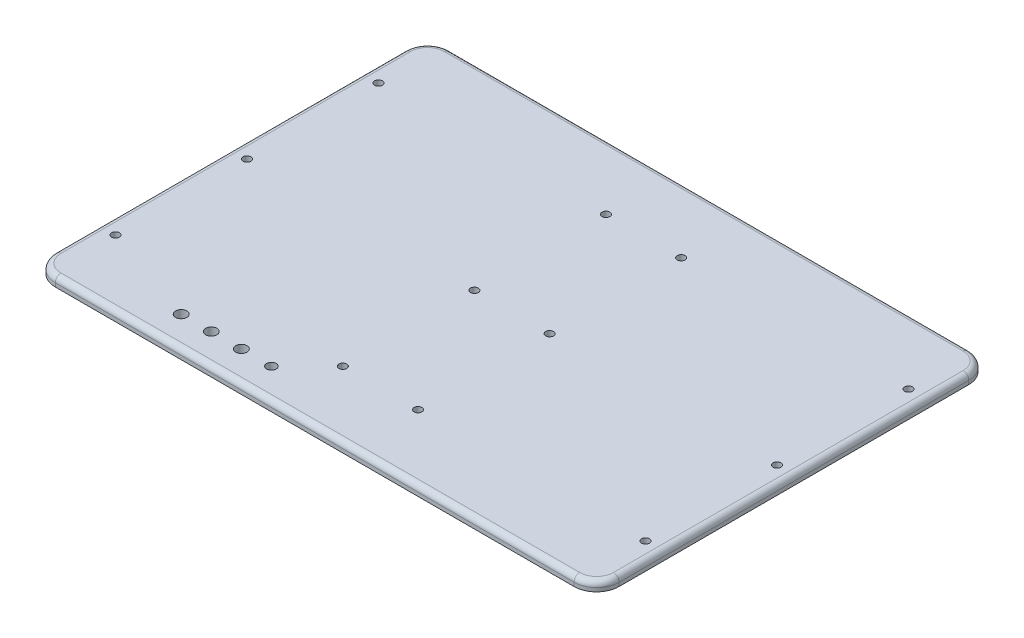
ISO-10303-21;
HEADER;
FILE_DESCRIPTION(('STEP AP214'),'2;1');
FILE_NAME('part.step','',(''),(''),'','','');
FILE_SCHEMA(('AUTOMOTIVE_DESIGN { 1 0 10303 214 1 1 1 1 }'));
ENDSEC;
DATA;
#1=APPLICATION_CONTEXT('core data for automotive mechanical design processes');
#2=APPLICATION_PROTOCOL_DEFINITION('international standard','automotive_design',2000,#1);
#3=PRODUCT_CONTEXT('',#1,'mechanical');
#4=PRODUCT('Part','Part','',(#3));
#5=PRODUCT_RELATED_PRODUCT_CATEGORY('part','',(#4));
#6=PRODUCT_DEFINITION_FORMATION('','',#4);
#7=PRODUCT_DEFINITION_CONTEXT('part definition',#1,'design');
#8=PRODUCT_DEFINITION('design','',#6,#7);
#9=PRODUCT_DEFINITION_SHAPE('','',#8);
#10=(LENGTH_UNIT() NAMED_UNIT(*) SI_UNIT(.MILLI.,.METRE.));
#11=(NAMED_UNIT(*) PLANE_ANGLE_UNIT() SI_UNIT($,.RADIAN.));
#12=(NAMED_UNIT(*) SI_UNIT($,.STERADIAN.) SOLID_ANGLE_UNIT());
#13=UNCERTAINTY_MEASURE_WITH_UNIT(LENGTH_MEASURE(1.E-05),#10,'distance_accuracy_value','');
#14=(GEOMETRIC_REPRESENTATION_CONTEXT(3) GLOBAL_UNCERTAINTY_ASSIGNED_CONTEXT((#13)) GLOBAL_UNIT_ASSIGNED_CONTEXT((#10,
#11,#12)) REPRESENTATION_CONTEXT('',''));
#15=CARTESIAN_POINT('',(0.,0.,0.));
#16=DIRECTION('',(0.,0.,1.));
#17=DIRECTION('',(1.,0.,0.));
#18=AXIS2_PLACEMENT_3D('',#15,#16,#17);
#19=CARTESIAN_POINT('',(150.,5.,-105.));
#20=DIRECTION('',(-1.,0.,0.));
#21=DIRECTION('',(0.,0.,1.));
#22=AXIS2_PLACEMENT_3D('',#19,#20,#21);
#23=PLANE('',#22);
#24=DIRECTION('',(0.,-1.,0.));
#25=VECTOR('',#24,1.);
#26=CARTESIAN_POINT('',(150.,5.,-93.));
#27=LINE('',#26,#25);
#28=CARTESIAN_POINT('',(150.,0.,-93.));
#29=VERTEX_POINT('',#28);
#30=CARTESIAN_POINT('',(150.,2.,-93.));
#31=VERTEX_POINT('',#30);
#32=EDGE_CURVE('E158',#29,#31,#27,.F.);
#33=ORIENTED_EDGE('',*,*,#32,.T.);
#34=DIRECTION('',(0.,0.,-1.));
#35=VECTOR('',#34,1.);
#36=CARTESIAN_POINT('',(150.,2.,93.));
#37=LINE('',#36,#35);
#38=CARTESIAN_POINT('',(150.,2.,93.));
#39=VERTEX_POINT('',#38);
#40=EDGE_CURVE('E241',#31,#39,#37,.F.);
#41=ORIENTED_EDGE('',*,*,#40,.T.);
#42=DIRECTION('',(0.,-1.,0.));
#43=VECTOR('',#42,1.);
#44=CARTESIAN_POINT('',(150.,5.,93.));
#45=LINE('',#44,#43);
#46=CARTESIAN_POINT('',(150.,0.,93.));
#47=VERTEX_POINT('',#46);
#48=EDGE_CURVE('E163',#39,#47,#45,.T.);
#49=ORIENTED_EDGE('',*,*,#48,.T.);
#50=DIRECTION('',(0.,0.,-1.));
#51=VECTOR('',#50,1.);
#52=CARTESIAN_POINT('',(150.,0.,-105.));
#53=LINE('',#52,#51);
#54=EDGE_CURVE('E171',#47,#29,#53,.T.);
#55=ORIENTED_EDGE('',*,*,#54,.T.);
#56=EDGE_LOOP('',(#33,#41,#49,#55));
#57=FACE_BOUND('',#56,.T.);
#58=ADVANCED_FACE('F49',(#57),#23,.F.);
#59=CARTESIAN_POINT('',(-150.,5.,-105.));
#60=DIRECTION('',(0.,0.,1.));
#61=DIRECTION('',(1.,0.,0.));
#62=AXIS2_PLACEMENT_3D('',#59,#60,#61);
#63=PLANE('',#62);
#64=DIRECTION('',(0.,-1.,0.));
#65=VECTOR('',#64,1.);
#66=CARTESIAN_POINT('',(-138.,5.,-105.));
#67=LINE('',#66,#65);
#68=CARTESIAN_POINT('',(-138.,0.,-105.));
#69=VERTEX_POINT('',#68);
#70=CARTESIAN_POINT('',(-138.,2.,-105.));
#71=VERTEX_POINT('',#70);
#72=EDGE_CURVE('E152',#69,#71,#67,.F.);
#73=ORIENTED_EDGE('',*,*,#72,.T.);
#74=DIRECTION('',(-1.,0.,0.));
#75=VECTOR('',#74,1.);
#76=CARTESIAN_POINT('',(138.,2.,-105.));
#77=LINE('',#76,#75);
#78=CARTESIAN_POINT('',(138.,2.,-105.));
#79=VERTEX_POINT('',#78);
#80=EDGE_CURVE('E11',#71,#79,#77,.F.);
#81=ORIENTED_EDGE('',*,*,#80,.T.);
#82=DIRECTION('',(0.,-1.,0.));
#83=VECTOR('',#82,1.);
#84=CARTESIAN_POINT('',(138.,5.,-105.));
#85=LINE('',#84,#83);
#86=CARTESIAN_POINT('',(138.,0.,-105.));
#87=VERTEX_POINT('',#86);
#88=EDGE_CURVE('E141',#79,#87,#85,.T.);
#89=ORIENTED_EDGE('',*,*,#88,.T.);
#90=DIRECTION('',(-1.,0.,0.));
#91=VECTOR('',#90,1.);
#92=CARTESIAN_POINT('',(-150.,0.,-105.));
#93=LINE('',#92,#91);
#94=EDGE_CURVE('E145',#87,#69,#93,.T.);
#95=ORIENTED_EDGE('',*,*,#94,.T.);
#96=EDGE_LOOP('',(#73,#81,#89,#95));
#97=FACE_BOUND('',#96,.T.);
#98=ADVANCED_FACE('F143',(#97),#63,.F.);
#99=CARTESIAN_POINT('',(-150.,5.,-105.));
#100=DIRECTION('',(1.,0.,0.));
#101=DIRECTION('',(0.,0.,-1.));
#102=AXIS2_PLACEMENT_3D('',#99,#100,#101);
#103=PLANE('',#102);
#104=DIRECTION('',(0.,-1.,0.));
#105=VECTOR('',#104,1.);
#106=CARTESIAN_POINT('',(-150.,5.,93.));
#107=LINE('',#106,#105);
#108=CARTESIAN_POINT('',(-150.,0.,93.));
#109=VERTEX_POINT('',#108);
#110=CARTESIAN_POINT('',(-150.,2.,93.));
#111=VERTEX_POINT('',#110);
#112=EDGE_CURVE('E210',#109,#111,#107,.F.);
#113=ORIENTED_EDGE('',*,*,#112,.T.);
#114=DIRECTION('',(0.,0.,1.));
#115=VECTOR('',#114,1.);
#116=CARTESIAN_POINT('',(-150.,2.,-93.));
#117=LINE('',#116,#115);
#118=CARTESIAN_POINT('',(-150.,2.,-93.));
#119=VERTEX_POINT('',#118);
#120=EDGE_CURVE('E74',#111,#119,#117,.F.);
#121=ORIENTED_EDGE('',*,*,#120,.T.);
#122=DIRECTION('',(0.,-1.,0.));
#123=VECTOR('',#122,1.);
#124=CARTESIAN_POINT('',(-150.,5.,-93.));
#125=LINE('',#124,#123);
#126=CARTESIAN_POINT('',(-150.,0.,-93.));
#127=VERTEX_POINT('',#126);
#128=EDGE_CURVE('E207',#119,#127,#125,.T.);
#129=ORIENTED_EDGE('',*,*,#128,.T.);
#130=DIRECTION('',(0.,0.,1.));
#131=VECTOR('',#130,1.);
#132=CARTESIAN_POINT('',(-150.,0.,-105.));
#133=LINE('',#132,#131);
#134=EDGE_CURVE('E170',#127,#109,#133,.T.);
#135=ORIENTED_EDGE('',*,*,#134,.T.);
#136=EDGE_LOOP('',(#113,#121,#129,#135));
#137=FACE_BOUND('',#136,.T.);
#138=ADVANCED_FACE('F402',(#137),#103,.F.);
#139=CARTESIAN_POINT('',(-150.,5.,105.));
#140=DIRECTION('',(0.,0.,-1.));
#141=DIRECTION('',(-1.,0.,0.));
#142=AXIS2_PLACEMENT_3D('',#139,#140,#141);
#143=PLANE('',#142);
#144=DIRECTION('',(0.,-1.,0.));
#145=VECTOR('',#144,1.);
#146=CARTESIAN_POINT('',(138.,5.,105.));
#147=LINE('',#146,#145);
#148=CARTESIAN_POINT('',(138.,0.,105.));
#149=VERTEX_POINT('',#148);
#150=CARTESIAN_POINT('',(138.,2.,105.));
#151=VERTEX_POINT('',#150);
#152=EDGE_CURVE('E203',#149,#151,#147,.F.);
#153=ORIENTED_EDGE('',*,*,#152,.T.);
#154=DIRECTION('',(1.,0.,0.));
#155=VECTOR('',#154,1.);
#156=CARTESIAN_POINT('',(-138.,2.,105.));
#157=LINE('',#156,#155);
#158=CARTESIAN_POINT('',(-138.,2.,105.));
#159=VERTEX_POINT('',#158);
#160=EDGE_CURVE('E247',#151,#159,#157,.F.);
#161=ORIENTED_EDGE('',*,*,#160,.T.);
#162=DIRECTION('',(0.,-1.,0.));
#163=VECTOR('',#162,1.);
#164=CARTESIAN_POINT('',(-138.,5.,105.));
#165=LINE('',#164,#163);
#166=CARTESIAN_POINT('',(-138.,0.,105.));
#167=VERTEX_POINT('',#166);
#168=EDGE_CURVE('E200',#159,#167,#165,.T.);
#169=ORIENTED_EDGE('',*,*,#168,.T.);
#170=DIRECTION('',(1.,0.,0.));
#171=VECTOR('',#170,1.);
#172=CARTESIAN_POINT('',(-150.,0.,105.));
#173=LINE('',#172,#171);
#174=EDGE_CURVE('E177',#167,#149,#173,.T.);
#175=ORIENTED_EDGE('',*,*,#174,.T.);
#176=EDGE_LOOP('',(#153,#161,#169,#175));
#177=FACE_BOUND('',#176,.T.);
#178=ADVANCED_FACE('F394',(#177),#143,.F.);
#179=CARTESIAN_POINT('',(0.,5.,0.));
#180=DIRECTION('',(0.,1.,0.));
#181=DIRECTION('',(0.,0.,1.));
#182=AXIS2_PLACEMENT_3D('',#179,#180,#181);
#183=PLANE('',#182);
#184=CARTESIAN_POINT('',(-87.,5.,89.));
#185=DIRECTION('',(0.,1.,0.));
#186=DIRECTION('',(0.,0.,1.));
#187=AXIS2_PLACEMENT_3D('',#184,#185,#186);
#188=CIRCLE('',#187,3.00000000000001);
#189=CARTESIAN_POINT('',(-87.,5.,92.));
#190=VERTEX_POINT('',#189);
#191=EDGE_CURVE('E764',#190,#190,#188,.T.);
#192=ORIENTED_EDGE('',*,*,#191,.F.);
#193=EDGE_LOOP('',(#192));
#194=FACE_BOUND('',#193,.T.);
#195=CARTESIAN_POINT('',(-55.,5.,89.));
#196=DIRECTION('',(0.,1.,0.));
#197=DIRECTION('',(0.,0.,1.));
#198=AXIS2_PLACEMENT_3D('',#195,#196,#197);
#199=CIRCLE('',#198,3.00000000000001);
#200=CARTESIAN_POINT('',(-55.,5.,92.));
#201=VERTEX_POINT('',#200);
#202=EDGE_CURVE('E779',#201,#201,#199,.T.);
#203=ORIENTED_EDGE('',*,*,#202,.F.);
#204=EDGE_LOOP('',(#203));
#205=FACE_BOUND('',#204,.T.);
#206=CARTESIAN_POINT('',(-71.,5.,89.));
#207=DIRECTION('',(0.,1.,0.));
#208=DIRECTION('',(0.,0.,1.));
#209=AXIS2_PLACEMENT_3D('',#206,#207,#208);
#210=CIRCLE('',#209,3.00000000000001);
#211=CARTESIAN_POINT('',(-71.,5.,92.));
#212=VERTEX_POINT('',#211);
#213=EDGE_CURVE('E778',#212,#212,#210,.T.);
#214=ORIENTED_EDGE('',*,*,#213,.F.);
#215=EDGE_LOOP('',(#214));
#216=FACE_BOUND('',#215,.T.);
#217=CARTESIAN_POINT('',(-39.,5.,89.));
#218=DIRECTION('',(0.,1.,0.));
#219=DIRECTION('',(0.,0.,1.));
#220=AXIS2_PLACEMENT_3D('',#217,#218,#219);
#221=CIRCLE('',#220,2.56);
#222=CARTESIAN_POINT('',(-39.,5.,91.56));
#223=VERTEX_POINT('',#222);
#224=EDGE_CURVE('E771',#223,#223,#221,.T.);
#225=ORIENTED_EDGE('',*,*,#224,.F.);
#226=EDGE_LOOP('',(#225));
#227=FACE_BOUND('',#226,.T.);
#228=DIRECTION('',(0.,0.,-1.));
#229=VECTOR('',#228,1.);
#230=CARTESIAN_POINT('',(147.,5.,-93.));
#231=LINE('',#230,#229);
#232=CARTESIAN_POINT('',(147.,5.,93.));
#233=VERTEX_POINT('',#232);
#234=CARTESIAN_POINT('',(147.,5.,-93.));
#235=VERTEX_POINT('',#234);
#236=EDGE_CURVE('E231',#233,#235,#231,.T.);
#237=ORIENTED_EDGE('',*,*,#236,.T.);
#238=CARTESIAN_POINT('',(138.,5.,-93.));
#239=DIRECTION('',(0.,1.,0.));
#240=DIRECTION('',(0.,0.,1.));
#241=AXIS2_PLACEMENT_3D('',#238,#239,#240);
#242=CIRCLE('',#241,9.);
#243=CARTESIAN_POINT('',(138.,5.,-102.));
#244=VERTEX_POINT('',#243);
#245=EDGE_CURVE('E234',#235,#244,#242,.T.);
#246=ORIENTED_EDGE('',*,*,#245,.T.);
#247=DIRECTION('',(-1.,0.,0.));
#248=VECTOR('',#247,1.);
#249=CARTESIAN_POINT('',(-138.,5.,-102.));
#250=LINE('',#249,#248);
#251=CARTESIAN_POINT('',(-138.,5.,-102.));
#252=VERTEX_POINT('',#251);
#253=EDGE_CURVE('E213',#244,#252,#250,.T.);
#254=ORIENTED_EDGE('',*,*,#253,.T.);
#255=CARTESIAN_POINT('',(-138.,5.,-93.));
#256=DIRECTION('',(0.,1.,0.));
#257=DIRECTION('',(0.,0.,1.));
#258=AXIS2_PLACEMENT_3D('',#255,#256,#257);
#259=CIRCLE('',#258,9.);
#260=CARTESIAN_POINT('',(-147.,5.,-93.));
#261=VERTEX_POINT('',#260);
#262=EDGE_CURVE('E216',#252,#261,#259,.T.);
#263=ORIENTED_EDGE('',*,*,#262,.T.);
#264=DIRECTION('',(0.,0.,1.));
#265=VECTOR('',#264,1.);
#266=CARTESIAN_POINT('',(-147.,5.,93.));
#267=LINE('',#266,#265);
#268=CARTESIAN_POINT('',(-147.,5.,93.));
#269=VERTEX_POINT('',#268);
#270=EDGE_CURVE('E219',#261,#269,#267,.T.);
#271=ORIENTED_EDGE('',*,*,#270,.T.);
#272=CARTESIAN_POINT('',(-138.,5.,93.));
#273=DIRECTION('',(0.,1.,0.));
#274=DIRECTION('',(0.,0.,1.));
#275=AXIS2_PLACEMENT_3D('',#272,#273,#274);
#276=CIRCLE('',#275,9.);
#277=CARTESIAN_POINT('',(-138.,5.,102.));
#278=VERTEX_POINT('',#277);
#279=EDGE_CURVE('E222',#269,#278,#276,.T.);
#280=ORIENTED_EDGE('',*,*,#279,.T.);
#281=DIRECTION('',(1.,0.,0.));
#282=VECTOR('',#281,1.);
#283=CARTESIAN_POINT('',(138.,5.,102.));
#284=LINE('',#283,#282);
#285=CARTESIAN_POINT('',(138.,5.,102.));
#286=VERTEX_POINT('',#285);
#287=EDGE_CURVE('E225',#278,#286,#284,.T.);
#288=ORIENTED_EDGE('',*,*,#287,.T.);
#289=CARTESIAN_POINT('',(138.,5.,93.));
#290=DIRECTION('',(0.,1.,0.));
#291=DIRECTION('',(0.,0.,1.));
#292=AXIS2_PLACEMENT_3D('',#289,#290,#291);
#293=CIRCLE('',#292,9.);
#294=EDGE_CURVE('E228',#286,#233,#293,.T.);
#295=ORIENTED_EDGE('',*,*,#294,.T.);
#296=EDGE_LOOP('',(#237,#246,#254,#263,#271,#280,#288,#295));
#297=FACE_BOUND('',#296,.T.);
#298=CARTESIAN_POINT('',(20.,5.,0.));
#299=DIRECTION('',(0.,-1.,0.));
#300=DIRECTION('',(0.,0.,1.));
#301=AXIS2_PLACEMENT_3D('',#298,#299,#300);
#302=CIRCLE('',#301,2.07499999999999);
#303=CARTESIAN_POINT('',(20.,5.,2.07499999999999));
#304=VERTEX_POINT('',#303);
#305=EDGE_CURVE('E301',#304,#304,#302,.T.);
#306=ORIENTED_EDGE('',*,*,#305,.T.);
#307=EDGE_LOOP('',(#306));
#308=FACE_BOUND('',#307,.T.);
#309=CARTESIAN_POINT('',(140.999999999999,5.,70.));
#310=DIRECTION('',(0.,-1.,0.));
#311=DIRECTION('',(0.,0.,1.));
#312=AXIS2_PLACEMENT_3D('',#309,#310,#311);
#313=CIRCLE('',#312,2.075);
#314=CARTESIAN_POINT('',(140.999999999999,5.,72.075));
#315=VERTEX_POINT('',#314);
#316=EDGE_CURVE('E310',#315,#315,#313,.T.);
#317=ORIENTED_EDGE('',*,*,#316,.T.);
#318=EDGE_LOOP('',(#317));
#319=FACE_BOUND('',#318,.T.);
#320=CARTESIAN_POINT('',(141.,5.,0.));
#321=DIRECTION('',(0.,-1.,0.));
#322=DIRECTION('',(0.,0.,1.));
#323=AXIS2_PLACEMENT_3D('',#320,#321,#322);
#324=CIRCLE('',#323,2.075);
#325=CARTESIAN_POINT('',(141.,5.,2.075));
#326=VERTEX_POINT('',#325);
#327=EDGE_CURVE('E309',#326,#326,#324,.T.);
#328=ORIENTED_EDGE('',*,*,#327,.T.);
#329=EDGE_LOOP('',(#328));
#330=FACE_BOUND('',#329,.T.);
#331=CARTESIAN_POINT('',(20.,5.,-70.));
#332=DIRECTION('',(0.,-1.,0.));
#333=DIRECTION('',(0.,0.,1.));
#334=AXIS2_PLACEMENT_3D('',#331,#332,#333);
#335=CIRCLE('',#334,2.07499999999999);
#336=CARTESIAN_POINT('',(20.,5.,-67.925));
#337=VERTEX_POINT('',#336);
#338=EDGE_CURVE('E326',#337,#337,#335,.T.);
#339=ORIENTED_EDGE('',*,*,#338,.T.);
#340=EDGE_LOOP('',(#339));
#341=FACE_BOUND('',#340,.T.);
#342=CARTESIAN_POINT('',(20.,5.,70.));
#343=DIRECTION('',(0.,-1.,0.));
#344=DIRECTION('',(0.,0.,1.));
#345=AXIS2_PLACEMENT_3D('',#342,#343,#344);
#346=CIRCLE('',#345,2.07499999999999);
#347=CARTESIAN_POINT('',(20.,5.,72.075));
#348=VERTEX_POINT('',#347);
#349=EDGE_CURVE('E287',#348,#348,#346,.T.);
#350=ORIENTED_EDGE('',*,*,#349,.T.);
#351=EDGE_LOOP('',(#350));
#352=FACE_BOUND('',#351,.T.);
#353=CARTESIAN_POINT('',(141.000000000001,5.,-70.));
#354=DIRECTION('',(0.,-1.,0.));
#355=DIRECTION('',(0.,0.,1.));
#356=AXIS2_PLACEMENT_3D('',#353,#354,#355);
#357=CIRCLE('',#356,2.07500000000064);
#358=CARTESIAN_POINT('',(141.000000000001,5.,-67.9249999999993));
#359=VERTEX_POINT('',#358);
#360=EDGE_CURVE('E325',#359,#359,#357,.T.);
#361=ORIENTED_EDGE('',*,*,#360,.T.);
#362=EDGE_LOOP('',(#361));
#363=FACE_BOUND('',#362,.T.);
#364=CARTESIAN_POINT('',(-20.,5.,0.));
#365=DIRECTION('',(0.,1.,0.));
#366=DIRECTION('',(0.,0.,1.));
#367=AXIS2_PLACEMENT_3D('',#364,#365,#366);
#368=CIRCLE('',#367,2.07499999999999);
#369=CARTESIAN_POINT('',(-20.,5.,2.07499999999999));
#370=VERTEX_POINT('',#369);
#371=EDGE_CURVE('E349',#370,#370,#368,.T.);
#372=ORIENTED_EDGE('',*,*,#371,.F.);
#373=EDGE_LOOP('',(#372));
#374=FACE_BOUND('',#373,.T.);
#375=CARTESIAN_POINT('',(-140.999999999999,5.,70.));
#376=DIRECTION('',(0.,1.,0.));
#377=DIRECTION('',(0.,0.,1.));
#378=AXIS2_PLACEMENT_3D('',#375,#376,#377);
#379=CIRCLE('',#378,2.075);
#380=CARTESIAN_POINT('',(-140.999999999999,5.,72.075));
#381=VERTEX_POINT('',#380);
#382=EDGE_CURVE('E358',#381,#381,#379,.T.);
#383=ORIENTED_EDGE('',*,*,#382,.F.);
#384=EDGE_LOOP('',(#383));
#385=FACE_BOUND('',#384,.T.);
#386=CARTESIAN_POINT('',(-141.,5.,0.));
#387=DIRECTION('',(0.,1.,0.));
#388=DIRECTION('',(0.,0.,1.));
#389=AXIS2_PLACEMENT_3D('',#386,#387,#388);
#390=CIRCLE('',#389,2.075);
#391=CARTESIAN_POINT('',(-141.,5.,2.075));
#392=VERTEX_POINT('',#391);
#393=EDGE_CURVE('E357',#392,#392,#390,.T.);
#394=ORIENTED_EDGE('',*,*,#393,.F.);
#395=EDGE_LOOP('',(#394));
#396=FACE_BOUND('',#395,.T.);
#397=CARTESIAN_POINT('',(-20.,5.,-70.));
#398=DIRECTION('',(0.,1.,0.));
#399=DIRECTION('',(0.,0.,1.));
#400=AXIS2_PLACEMENT_3D('',#397,#398,#399);
#401=CIRCLE('',#400,2.07499999999999);
#402=CARTESIAN_POINT('',(-20.,5.,-67.925));
#403=VERTEX_POINT('',#402);
#404=EDGE_CURVE('E373',#403,#403,#401,.T.);
#405=ORIENTED_EDGE('',*,*,#404,.F.);
#406=EDGE_LOOP('',(#405));
#407=FACE_BOUND('',#406,.T.);
#408=CARTESIAN_POINT('',(-20.,5.,70.));
#409=DIRECTION('',(0.,1.,0.));
#410=DIRECTION('',(0.,0.,1.));
#411=AXIS2_PLACEMENT_3D('',#408,#409,#410);
#412=CIRCLE('',#411,2.07499999999999);
#413=CARTESIAN_POINT('',(-20.,5.,72.075));
#414=VERTEX_POINT('',#413);
#415=EDGE_CURVE('E341',#414,#414,#412,.T.);
#416=ORIENTED_EDGE('',*,*,#415,.F.);
#417=EDGE_LOOP('',(#416));
#418=FACE_BOUND('',#417,.T.);
#419=CARTESIAN_POINT('',(-141.000000000001,5.,-70.));
#420=DIRECTION('',(0.,1.,0.));
#421=DIRECTION('',(0.,0.,1.));
#422=AXIS2_PLACEMENT_3D('',#419,#420,#421);
#423=CIRCLE('',#422,2.07500000000064);
#424=CARTESIAN_POINT('',(-141.000000000001,5.,-67.9249999999993));
#425=VERTEX_POINT('',#424);
#426=EDGE_CURVE('E372',#425,#425,#423,.T.);
#427=ORIENTED_EDGE('',*,*,#426,.F.);
#428=EDGE_LOOP('',(#427));
#429=FACE_BOUND('',#428,.T.);
#430=ADVANCED_FACE('F392',(#194,#205,#216,#227,#297,#308,#319,#330,#341,#352,#363,#374,#385,
#396,#407,#418,#429),#183,.T.);
#431=CARTESIAN_POINT('',(0.,0.,0.));
#432=DIRECTION('',(0.,1.,0.));
#433=DIRECTION('',(0.,0.,1.));
#434=AXIS2_PLACEMENT_3D('',#431,#432,#433);
#435=PLANE('',#434);
#436=CARTESIAN_POINT('',(-87.,0.,89.));
#437=DIRECTION('',(0.,1.,0.));
#438=DIRECTION('',(0.,0.,1.));
#439=AXIS2_PLACEMENT_3D('',#436,#437,#438);
#440=CIRCLE('',#439,3.00000000000001);
#441=CARTESIAN_POINT('',(-87.,0.,92.));
#442=VERTEX_POINT('',#441);
#443=EDGE_CURVE('E261',#442,#442,#440,.T.);
#444=ORIENTED_EDGE('',*,*,#443,.T.);
#445=EDGE_LOOP('',(#444));
#446=FACE_BOUND('',#445,.T.);
#447=CARTESIAN_POINT('',(-55.,0.,89.));
#448=DIRECTION('',(0.,1.,0.));
#449=DIRECTION('',(0.,0.,1.));
#450=AXIS2_PLACEMENT_3D('',#447,#448,#449);
#451=CIRCLE('',#450,3.00000000000001);
#452=CARTESIAN_POINT('',(-55.,0.,92.));
#453=VERTEX_POINT('',#452);
#454=EDGE_CURVE('E774',#453,#453,#451,.T.);
#455=ORIENTED_EDGE('',*,*,#454,.T.);
#456=EDGE_LOOP('',(#455));
#457=FACE_BOUND('',#456,.T.);
#458=CARTESIAN_POINT('',(-71.,0.,89.));
#459=DIRECTION('',(0.,1.,0.));
#460=DIRECTION('',(0.,0.,1.));
#461=AXIS2_PLACEMENT_3D('',#458,#459,#460);
#462=CIRCLE('',#461,3.00000000000001);
#463=CARTESIAN_POINT('',(-71.,0.,92.));
#464=VERTEX_POINT('',#463);
#465=EDGE_CURVE('E786',#464,#464,#462,.T.);
#466=ORIENTED_EDGE('',*,*,#465,.T.);
#467=EDGE_LOOP('',(#466));
#468=FACE_BOUND('',#467,.T.);
#469=CARTESIAN_POINT('',(-39.,0.,89.));
#470=DIRECTION('',(0.,1.,0.));
#471=DIRECTION('',(0.,0.,1.));
#472=AXIS2_PLACEMENT_3D('',#469,#470,#471);
#473=CIRCLE('',#472,2.56);
#474=CARTESIAN_POINT('',(-39.,0.,91.56));
#475=VERTEX_POINT('',#474);
#476=EDGE_CURVE('E766',#475,#475,#473,.T.);
#477=ORIENTED_EDGE('',*,*,#476,.T.);
#478=EDGE_LOOP('',(#477));
#479=FACE_BOUND('',#478,.T.);
#480=CARTESIAN_POINT('',(20.,0.,0.));
#481=DIRECTION('',(0.,-1.,0.));
#482=DIRECTION('',(0.,0.,1.));
#483=AXIS2_PLACEMENT_3D('',#480,#481,#482);
#484=CIRCLE('',#483,2.07499999999999);
#485=CARTESIAN_POINT('',(20.,0.,2.07499999999999));
#486=VERTEX_POINT('',#485);
#487=EDGE_CURVE('E314',#486,#486,#484,.T.);
#488=ORIENTED_EDGE('',*,*,#487,.F.);
#489=EDGE_LOOP('',(#488));
#490=FACE_BOUND('',#489,.T.);
#491=CARTESIAN_POINT('',(140.999999999999,0.,70.));
#492=DIRECTION('',(0.,-1.,0.));
#493=DIRECTION('',(0.,0.,1.));
#494=AXIS2_PLACEMENT_3D('',#491,#492,#493);
#495=CIRCLE('',#494,2.075);
#496=CARTESIAN_POINT('',(140.999999999999,0.,72.075));
#497=VERTEX_POINT('',#496);
#498=EDGE_CURVE('E305',#497,#497,#495,.T.);
#499=ORIENTED_EDGE('',*,*,#498,.F.);
#500=EDGE_LOOP('',(#499));
#501=FACE_BOUND('',#500,.T.);
#502=CARTESIAN_POINT('',(141.,0.,0.));
#503=DIRECTION('',(0.,-1.,0.));
#504=DIRECTION('',(0.,0.,1.));
#505=AXIS2_PLACEMENT_3D('',#502,#503,#504);
#506=CIRCLE('',#505,2.075);
#507=CARTESIAN_POINT('',(141.,0.,2.075));
#508=VERTEX_POINT('',#507);
#509=EDGE_CURVE('E330',#508,#508,#506,.T.);
#510=ORIENTED_EDGE('',*,*,#509,.F.);
#511=EDGE_LOOP('',(#510));
#512=FACE_BOUND('',#511,.T.);
#513=CARTESIAN_POINT('',(20.,0.,-70.));
#514=DIRECTION('',(0.,-1.,0.));
#515=DIRECTION('',(0.,0.,1.));
#516=AXIS2_PLACEMENT_3D('',#513,#514,#515);
#517=CIRCLE('',#516,2.07499999999999);
#518=CARTESIAN_POINT('',(20.,0.,-67.925));
#519=VERTEX_POINT('',#518);
#520=EDGE_CURVE('E321',#519,#519,#517,.T.);
#521=ORIENTED_EDGE('',*,*,#520,.F.);
#522=EDGE_LOOP('',(#521));
#523=FACE_BOUND('',#522,.T.);
#524=CARTESIAN_POINT('',(20.,0.,70.));
#525=DIRECTION('',(0.,-1.,0.));
#526=DIRECTION('',(0.,0.,1.));
#527=AXIS2_PLACEMENT_3D('',#524,#525,#526);
#528=CIRCLE('',#527,2.07499999999999);
#529=CARTESIAN_POINT('',(20.,0.,72.075));
#530=VERTEX_POINT('',#529);
#531=EDGE_CURVE('E294',#530,#530,#528,.T.);
#532=ORIENTED_EDGE('',*,*,#531,.F.);
#533=EDGE_LOOP('',(#532));
#534=FACE_BOUND('',#533,.T.);
#535=CARTESIAN_POINT('',(141.000000000001,0.,-70.));
#536=DIRECTION('',(0.,-1.,0.));
#537=DIRECTION('',(0.,0.,1.));
#538=AXIS2_PLACEMENT_3D('',#535,#536,#537);
#539=CIRCLE('',#538,2.07500000000064);
#540=CARTESIAN_POINT('',(141.000000000001,0.,-67.9249999999993));
#541=VERTEX_POINT('',#540);
#542=EDGE_CURVE('E337',#541,#541,#539,.T.);
#543=ORIENTED_EDGE('',*,*,#542,.F.);
#544=EDGE_LOOP('',(#543));
#545=FACE_BOUND('',#544,.T.);
#546=CARTESIAN_POINT('',(-20.,0.,0.));
#547=DIRECTION('',(0.,1.,0.));
#548=DIRECTION('',(0.,0.,1.));
#549=AXIS2_PLACEMENT_3D('',#546,#547,#548);
#550=CIRCLE('',#549,2.07499999999999);
#551=CARTESIAN_POINT('',(-20.,0.,2.07499999999999));
#552=VERTEX_POINT('',#551);
#553=EDGE_CURVE('E362',#552,#552,#550,.T.);
#554=ORIENTED_EDGE('',*,*,#553,.T.);
#555=EDGE_LOOP('',(#554));
#556=FACE_BOUND('',#555,.T.);
#557=CARTESIAN_POINT('',(-140.999999999999,0.,70.));
#558=DIRECTION('',(0.,1.,0.));
#559=DIRECTION('',(0.,0.,1.));
#560=AXIS2_PLACEMENT_3D('',#557,#558,#559);
#561=CIRCLE('',#560,2.075);
#562=CARTESIAN_POINT('',(-140.999999999999,0.,72.075));
#563=VERTEX_POINT('',#562);
#564=EDGE_CURVE('E353',#563,#563,#561,.T.);
#565=ORIENTED_EDGE('',*,*,#564,.T.);
#566=EDGE_LOOP('',(#565));
#567=FACE_BOUND('',#566,.T.);
#568=CARTESIAN_POINT('',(-141.,0.,0.));
#569=DIRECTION('',(0.,1.,0.));
#570=DIRECTION('',(0.,0.,1.));
#571=AXIS2_PLACEMENT_3D('',#568,#569,#570);
#572=CIRCLE('',#571,2.075);
#573=CARTESIAN_POINT('',(-141.,0.,2.075));
#574=VERTEX_POINT('',#573);
#575=EDGE_CURVE('E377',#574,#574,#572,.T.);
#576=ORIENTED_EDGE('',*,*,#575,.T.);
#577=EDGE_LOOP('',(#576));
#578=FACE_BOUND('',#577,.T.);
#579=CARTESIAN_POINT('',(-20.,0.,-70.));
#580=DIRECTION('',(0.,1.,0.));
#581=DIRECTION('',(0.,0.,1.));
#582=AXIS2_PLACEMENT_3D('',#579,#580,#581);
#583=CIRCLE('',#582,2.07499999999999);
#584=CARTESIAN_POINT('',(-20.,0.,-67.925));
#585=VERTEX_POINT('',#584);
#586=EDGE_CURVE('E369',#585,#585,#583,.T.);
#587=ORIENTED_EDGE('',*,*,#586,.T.);
#588=EDGE_LOOP('',(#587));
#589=FACE_BOUND('',#588,.T.);
#590=CARTESIAN_POINT('',(-20.,0.,70.));
#591=DIRECTION('',(0.,1.,0.));
#592=DIRECTION('',(0.,0.,1.));
#593=AXIS2_PLACEMENT_3D('',#590,#591,#592);
#594=CIRCLE('',#593,2.07499999999999);
#595=CARTESIAN_POINT('',(-20.,0.,72.075));
#596=VERTEX_POINT('',#595);
#597=EDGE_CURVE('E345',#596,#596,#594,.T.);
#598=ORIENTED_EDGE('',*,*,#597,.T.);
#599=EDGE_LOOP('',(#598));
#600=FACE_BOUND('',#599,.T.);
#601=CARTESIAN_POINT('',(-141.000000000001,0.,-70.));
#602=DIRECTION('',(0.,1.,0.));
#603=DIRECTION('',(0.,0.,1.));
#604=AXIS2_PLACEMENT_3D('',#601,#602,#603);
#605=CIRCLE('',#604,2.07500000000064);
#606=CARTESIAN_POINT('',(-141.000000000001,0.,-67.9249999999993));
#607=VERTEX_POINT('',#606);
#608=EDGE_CURVE('E180',#607,#607,#605,.T.);
#609=ORIENTED_EDGE('',*,*,#608,.T.);
#610=EDGE_LOOP('',(#609));
#611=FACE_BOUND('',#610,.T.);
#612=ORIENTED_EDGE('',*,*,#94,.F.);
#613=CARTESIAN_POINT('',(138.,0.,-93.));
#614=DIRECTION('',(0.,1.,0.));
#615=DIRECTION('',(0.,0.,1.));
#616=AXIS2_PLACEMENT_3D('',#613,#614,#615);
#617=CIRCLE('',#616,12.);
#618=EDGE_CURVE('E155',#87,#29,#617,.F.);
#619=ORIENTED_EDGE('',*,*,#618,.T.);
#620=ORIENTED_EDGE('',*,*,#54,.F.);
#621=CARTESIAN_POINT('',(138.,0.,93.));
#622=DIRECTION('',(0.,1.,0.));
#623=DIRECTION('',(0.,0.,1.));
#624=AXIS2_PLACEMENT_3D('',#621,#622,#623);
#625=CIRCLE('',#624,12.);
#626=EDGE_CURVE('E164',#47,#149,#625,.F.);
#627=ORIENTED_EDGE('',*,*,#626,.T.);
#628=ORIENTED_EDGE('',*,*,#174,.F.);
#629=CARTESIAN_POINT('',(-138.,0.,93.));
#630=DIRECTION('',(0.,1.,0.));
#631=DIRECTION('',(0.,0.,1.));
#632=AXIS2_PLACEMENT_3D('',#629,#630,#631);
#633=CIRCLE('',#632,12.);
#634=EDGE_CURVE('E191',#167,#109,#633,.F.);
#635=ORIENTED_EDGE('',*,*,#634,.T.);
#636=ORIENTED_EDGE('',*,*,#134,.F.);
#637=CARTESIAN_POINT('',(-138.,0.,-93.));
#638=DIRECTION('',(0.,1.,0.));
#639=DIRECTION('',(0.,0.,1.));
#640=AXIS2_PLACEMENT_3D('',#637,#638,#639);
#641=CIRCLE('',#640,12.);
#642=EDGE_CURVE('E151',#127,#69,#641,.F.);
#643=ORIENTED_EDGE('',*,*,#642,.T.);
#644=EDGE_LOOP('',(#612,#619,#620,#627,#628,#635,#636,#643));
#645=FACE_BOUND('',#644,.T.);
#646=ADVANCED_FACE('F166',(#446,#457,#468,#479,#490,#501,#512,#523,#534,#545,#556,#567,#578,
#589,#600,#611,#645),#435,.F.);
#647=CARTESIAN_POINT('',(138.,5.,-93.));
#648=DIRECTION('',(0.,-1.,0.));
#649=DIRECTION('',(0.,0.,-1.));
#650=AXIS2_PLACEMENT_3D('',#647,#648,#649);
#651=CYLINDRICAL_SURFACE('',#650,12.);
#652=ORIENTED_EDGE('',*,*,#88,.F.);
#653=CARTESIAN_POINT('',(138.,2.,-93.));
#654=DIRECTION('',(0.,1.,0.));
#655=DIRECTION('',(0.,0.,1.));
#656=AXIS2_PLACEMENT_3D('',#653,#654,#655);
#657=CIRCLE('',#656,12.);
#658=EDGE_CURVE('E238',#79,#31,#657,.F.);
#659=ORIENTED_EDGE('',*,*,#658,.T.);
#660=ORIENTED_EDGE('',*,*,#32,.F.);
#661=ORIENTED_EDGE('',*,*,#618,.F.);
#662=EDGE_LOOP('',(#652,#659,#660,#661));
#663=FACE_BOUND('',#662,.T.);
#664=ADVANCED_FACE('F156',(#663),#651,.T.);
#665=CARTESIAN_POINT('',(138.,5.,93.));
#666=DIRECTION('',(0.,-1.,0.));
#667=DIRECTION('',(0.,0.,-1.));
#668=AXIS2_PLACEMENT_3D('',#665,#666,#667);
#669=CYLINDRICAL_SURFACE('',#668,12.);
#670=ORIENTED_EDGE('',*,*,#48,.F.);
#671=CARTESIAN_POINT('',(138.,2.,93.));
#672=DIRECTION('',(0.,1.,0.));
#673=DIRECTION('',(0.,0.,1.));
#674=AXIS2_PLACEMENT_3D('',#671,#672,#673);
#675=CIRCLE('',#674,12.);
#676=EDGE_CURVE('E244',#39,#151,#675,.F.);
#677=ORIENTED_EDGE('',*,*,#676,.T.);
#678=ORIENTED_EDGE('',*,*,#152,.F.);
#679=ORIENTED_EDGE('',*,*,#626,.F.);
#680=EDGE_LOOP('',(#670,#677,#678,#679));
#681=FACE_BOUND('',#680,.T.);
#682=ADVANCED_FACE('F418',(#681),#669,.T.);
#683=CARTESIAN_POINT('',(-138.,5.,93.));
#684=DIRECTION('',(0.,-1.,0.));
#685=DIRECTION('',(0.,0.,-1.));
#686=AXIS2_PLACEMENT_3D('',#683,#684,#685);
#687=CYLINDRICAL_SURFACE('',#686,12.);
#688=ORIENTED_EDGE('',*,*,#168,.F.);
#689=CARTESIAN_POINT('',(-138.,2.,93.));
#690=DIRECTION('',(0.,1.,0.));
#691=DIRECTION('',(0.,0.,1.));
#692=AXIS2_PLACEMENT_3D('',#689,#690,#691);
#693=CIRCLE('',#692,12.);
#694=EDGE_CURVE('E250',#159,#111,#693,.F.);
#695=ORIENTED_EDGE('',*,*,#694,.T.);
#696=ORIENTED_EDGE('',*,*,#112,.F.);
#697=ORIENTED_EDGE('',*,*,#634,.F.);
#698=EDGE_LOOP('',(#688,#695,#696,#697));
#699=FACE_BOUND('',#698,.T.);
#700=ADVANCED_FACE('F421',(#699),#687,.T.);
#701=CARTESIAN_POINT('',(-138.,5.,-93.));
#702=DIRECTION('',(0.,-1.,0.));
#703=DIRECTION('',(0.,0.,-1.));
#704=AXIS2_PLACEMENT_3D('',#701,#702,#703);
#705=CYLINDRICAL_SURFACE('',#704,12.);
#706=ORIENTED_EDGE('',*,*,#128,.F.);
#707=CARTESIAN_POINT('',(-138.,2.,-93.));
#708=DIRECTION('',(0.,1.,0.));
#709=DIRECTION('',(0.,0.,1.));
#710=AXIS2_PLACEMENT_3D('',#707,#708,#709);
#711=CIRCLE('',#710,12.);
#712=EDGE_CURVE('E59',#119,#71,#711,.F.);
#713=ORIENTED_EDGE('',*,*,#712,.T.);
#714=ORIENTED_EDGE('',*,*,#72,.F.);
#715=ORIENTED_EDGE('',*,*,#642,.F.);
#716=EDGE_LOOP('',(#706,#713,#714,#715));
#717=FACE_BOUND('',#716,.T.);
#718=ADVANCED_FACE('F425',(#717),#705,.T.);
#719=CARTESIAN_POINT('',(-141.000000000001,0.,-70.));
#720=DIRECTION('',(0.,1.,0.));
#721=DIRECTION('',(0.,0.,1.));
#722=AXIS2_PLACEMENT_3D('',#719,#720,#721);
#723=CYLINDRICAL_SURFACE('',#722,2.07500000000064);
#724=ORIENTED_EDGE('',*,*,#608,.F.);
#725=EDGE_LOOP('',(#724));
#726=FACE_BOUND('',#725,.T.);
#727=ORIENTED_EDGE('',*,*,#426,.T.);
#728=EDGE_LOOP('',(#727));
#729=FACE_BOUND('',#728,.T.);
#730=ADVANCED_FACE('F390',(#726,#729),#723,.F.);
#731=CARTESIAN_POINT('',(-20.,0.,70.));
#732=DIRECTION('',(0.,1.,0.));
#733=DIRECTION('',(0.,0.,1.));
#734=AXIS2_PLACEMENT_3D('',#731,#732,#733);
#735=CYLINDRICAL_SURFACE('',#734,2.07499999999999);
#736=ORIENTED_EDGE('',*,*,#597,.F.);
#737=EDGE_LOOP('',(#736));
#738=FACE_BOUND('',#737,.T.);
#739=ORIENTED_EDGE('',*,*,#415,.T.);
#740=EDGE_LOOP('',(#739));
#741=FACE_BOUND('',#740,.T.);
#742=ADVANCED_FACE('F625',(#738,#741),#735,.F.);
#743=CARTESIAN_POINT('',(-20.,0.,-70.));
#744=DIRECTION('',(0.,1.,0.));
#745=DIRECTION('',(0.,0.,1.));
#746=AXIS2_PLACEMENT_3D('',#743,#744,#745);
#747=CYLINDRICAL_SURFACE('',#746,2.07499999999999);
#748=ORIENTED_EDGE('',*,*,#586,.F.);
#749=EDGE_LOOP('',(#748));
#750=FACE_BOUND('',#749,.T.);
#751=ORIENTED_EDGE('',*,*,#404,.T.);
#752=EDGE_LOOP('',(#751));
#753=FACE_BOUND('',#752,.T.);
#754=ADVANCED_FACE('F628',(#750,#753),#747,.F.);
#755=CARTESIAN_POINT('',(-141.,0.,0.));
#756=DIRECTION('',(0.,1.,0.));
#757=DIRECTION('',(0.,0.,1.));
#758=AXIS2_PLACEMENT_3D('',#755,#756,#757);
#759=CYLINDRICAL_SURFACE('',#758,2.075);
#760=ORIENTED_EDGE('',*,*,#575,.F.);
#761=EDGE_LOOP('',(#760));
#762=FACE_BOUND('',#761,.T.);
#763=ORIENTED_EDGE('',*,*,#393,.T.);
#764=EDGE_LOOP('',(#763));
#765=FACE_BOUND('',#764,.T.);
#766=ADVANCED_FACE('F633',(#762,#765),#759,.F.);
#767=CARTESIAN_POINT('',(-140.999999999999,0.,70.));
#768=DIRECTION('',(0.,1.,0.));
#769=DIRECTION('',(0.,0.,1.));
#770=AXIS2_PLACEMENT_3D('',#767,#768,#769);
#771=CYLINDRICAL_SURFACE('',#770,2.075);
#772=ORIENTED_EDGE('',*,*,#564,.F.);
#773=EDGE_LOOP('',(#772));
#774=FACE_BOUND('',#773,.T.);
#775=ORIENTED_EDGE('',*,*,#382,.T.);
#776=EDGE_LOOP('',(#775));
#777=FACE_BOUND('',#776,.T.);
#778=ADVANCED_FACE('F630',(#774,#777),#771,.F.);
#779=CARTESIAN_POINT('',(-20.,0.,0.));
#780=DIRECTION('',(0.,1.,0.));
#781=DIRECTION('',(0.,0.,1.));
#782=AXIS2_PLACEMENT_3D('',#779,#780,#781);
#783=CYLINDRICAL_SURFACE('',#782,2.07499999999999);
#784=ORIENTED_EDGE('',*,*,#553,.F.);
#785=EDGE_LOOP('',(#784));
#786=FACE_BOUND('',#785,.T.);
#787=ORIENTED_EDGE('',*,*,#371,.T.);
#788=EDGE_LOOP('',(#787));
#789=FACE_BOUND('',#788,.T.);
#790=ADVANCED_FACE('F623',(#786,#789),#783,.F.);
#791=CARTESIAN_POINT('',(141.000000000001,0.,-70.));
#792=DIRECTION('',(0.,1.,0.));
#793=DIRECTION('',(0.,0.,1.));
#794=AXIS2_PLACEMENT_3D('',#791,#792,#793);
#795=CYLINDRICAL_SURFACE('',#794,2.07500000000064);
#796=ORIENTED_EDGE('',*,*,#542,.T.);
#797=EDGE_LOOP('',(#796));
#798=FACE_BOUND('',#797,.T.);
#799=ORIENTED_EDGE('',*,*,#360,.F.);
#800=EDGE_LOOP('',(#799));
#801=FACE_BOUND('',#800,.T.);
#802=ADVANCED_FACE('F609',(#798,#801),#795,.F.);
#803=CARTESIAN_POINT('',(20.,0.,70.));
#804=DIRECTION('',(0.,1.,0.));
#805=DIRECTION('',(0.,0.,1.));
#806=AXIS2_PLACEMENT_3D('',#803,#804,#805);
#807=CYLINDRICAL_SURFACE('',#806,2.07499999999999);
#808=ORIENTED_EDGE('',*,*,#531,.T.);
#809=EDGE_LOOP('',(#808));
#810=FACE_BOUND('',#809,.T.);
#811=ORIENTED_EDGE('',*,*,#349,.F.);
#812=EDGE_LOOP('',(#811));
#813=FACE_BOUND('',#812,.T.);
#814=ADVANCED_FACE('F605',(#810,#813),#807,.F.);
#815=CARTESIAN_POINT('',(20.,0.,-70.));
#816=DIRECTION('',(0.,1.,0.));
#817=DIRECTION('',(0.,0.,1.));
#818=AXIS2_PLACEMENT_3D('',#815,#816,#817);
#819=CYLINDRICAL_SURFACE('',#818,2.07499999999999);
#820=ORIENTED_EDGE('',*,*,#520,.T.);
#821=EDGE_LOOP('',(#820));
#822=FACE_BOUND('',#821,.T.);
#823=ORIENTED_EDGE('',*,*,#338,.F.);
#824=EDGE_LOOP('',(#823));
#825=FACE_BOUND('',#824,.T.);
#826=ADVANCED_FACE('F608',(#822,#825),#819,.F.);
#827=CARTESIAN_POINT('',(141.,0.,0.));
#828=DIRECTION('',(0.,1.,0.));
#829=DIRECTION('',(0.,0.,1.));
#830=AXIS2_PLACEMENT_3D('',#827,#828,#829);
#831=CYLINDRICAL_SURFACE('',#830,2.075);
#832=ORIENTED_EDGE('',*,*,#509,.T.);
#833=EDGE_LOOP('',(#832));
#834=FACE_BOUND('',#833,.T.);
#835=ORIENTED_EDGE('',*,*,#327,.F.);
#836=EDGE_LOOP('',(#835));
#837=FACE_BOUND('',#836,.T.);
#838=ADVANCED_FACE('F612',(#834,#837),#831,.F.);
#839=CARTESIAN_POINT('',(140.999999999999,0.,70.));
#840=DIRECTION('',(0.,1.,0.));
#841=DIRECTION('',(0.,0.,1.));
#842=AXIS2_PLACEMENT_3D('',#839,#840,#841);
#843=CYLINDRICAL_SURFACE('',#842,2.075);
#844=ORIENTED_EDGE('',*,*,#498,.T.);
#845=EDGE_LOOP('',(#844));
#846=FACE_BOUND('',#845,.T.);
#847=ORIENTED_EDGE('',*,*,#316,.F.);
#848=EDGE_LOOP('',(#847));
#849=FACE_BOUND('',#848,.T.);
#850=ADVANCED_FACE('F460',(#846,#849),#843,.F.);
#851=CARTESIAN_POINT('',(20.,0.,0.));
#852=DIRECTION('',(0.,1.,0.));
#853=DIRECTION('',(0.,0.,1.));
#854=AXIS2_PLACEMENT_3D('',#851,#852,#853);
#855=CYLINDRICAL_SURFACE('',#854,2.07499999999999);
#856=ORIENTED_EDGE('',*,*,#487,.T.);
#857=EDGE_LOOP('',(#856));
#858=FACE_BOUND('',#857,.T.);
#859=ORIENTED_EDGE('',*,*,#305,.F.);
#860=EDGE_LOOP('',(#859));
#861=FACE_BOUND('',#860,.T.);
#862=ADVANCED_FACE('F456',(#858,#861),#855,.F.);
#863=CARTESIAN_POINT('',(-138.,2.,93.));
#864=DIRECTION('',(0.,1.,0.));
#865=DIRECTION('',(0.,0.,1.));
#866=AXIS2_PLACEMENT_3D('',#863,#864,#865);
#867=TOROIDAL_SURFACE('',#866,9.,3.);
#868=CARTESIAN_POINT('',(-147.,2.,93.));
#869=DIRECTION('',(0.,0.,-1.));
#870=DIRECTION('',(-1.,0.,0.));
#871=AXIS2_PLACEMENT_3D('',#868,#869,#870);
#872=CIRCLE('',#871,3.);
#873=EDGE_CURVE('E278',#111,#269,#872,.T.);
#874=ORIENTED_EDGE('',*,*,#873,.F.);
#875=ORIENTED_EDGE('',*,*,#694,.F.);
#876=CARTESIAN_POINT('',(-138.,2.,102.));
#877=DIRECTION('',(1.,0.,0.));
#878=DIRECTION('',(0.,0.,-1.));
#879=AXIS2_PLACEMENT_3D('',#876,#877,#878);
#880=CIRCLE('',#879,3.);
#881=EDGE_CURVE('E53',#278,#159,#880,.T.);
#882=ORIENTED_EDGE('',*,*,#881,.F.);
#883=ORIENTED_EDGE('',*,*,#279,.F.);
#884=EDGE_LOOP('',(#874,#875,#882,#883));
#885=FACE_BOUND('',#884,.T.);
#886=ADVANCED_FACE('F51',(#885),#867,.T.);
#887=CARTESIAN_POINT('',(0.,2.,102.));
#888=DIRECTION('',(-1.,0.,0.));
#889=DIRECTION('',(0.,0.,1.));
#890=AXIS2_PLACEMENT_3D('',#887,#888,#889);
#891=CYLINDRICAL_SURFACE('',#890,3.);
#892=ORIENTED_EDGE('',*,*,#881,.T.);
#893=ORIENTED_EDGE('',*,*,#160,.F.);
#894=CARTESIAN_POINT('',(138.,2.,102.));
#895=DIRECTION('',(1.,0.,0.));
#896=DIRECTION('',(0.,0.,-1.));
#897=AXIS2_PLACEMENT_3D('',#894,#895,#896);
#898=CIRCLE('',#897,3.);
#899=EDGE_CURVE('E275',#286,#151,#898,.T.);
#900=ORIENTED_EDGE('',*,*,#899,.F.);
#901=ORIENTED_EDGE('',*,*,#287,.F.);
#902=EDGE_LOOP('',(#892,#893,#900,#901));
#903=FACE_BOUND('',#902,.T.);
#904=ADVANCED_FACE('F452',(#903),#891,.T.);
#905=CARTESIAN_POINT('',(-147.,2.,0.));
#906=DIRECTION('',(0.,0.,-1.));
#907=DIRECTION('',(-1.,0.,0.));
#908=AXIS2_PLACEMENT_3D('',#905,#906,#907);
#909=CYLINDRICAL_SURFACE('',#908,3.);
#910=ORIENTED_EDGE('',*,*,#873,.T.);
#911=ORIENTED_EDGE('',*,*,#270,.F.);
#912=CARTESIAN_POINT('',(-147.,2.,-93.));
#913=DIRECTION('',(0.,0.,-1.));
#914=DIRECTION('',(-1.,0.,0.));
#915=AXIS2_PLACEMENT_3D('',#912,#913,#914);
#916=CIRCLE('',#915,3.);
#917=EDGE_CURVE('E271',#119,#261,#916,.T.);
#918=ORIENTED_EDGE('',*,*,#917,.F.);
#919=ORIENTED_EDGE('',*,*,#120,.F.);
#920=EDGE_LOOP('',(#910,#911,#918,#919));
#921=FACE_BOUND('',#920,.T.);
#922=ADVANCED_FACE('F449',(#921),#909,.T.);
#923=CARTESIAN_POINT('',(138.,2.,93.));
#924=DIRECTION('',(0.,1.,0.));
#925=DIRECTION('',(0.,0.,1.));
#926=AXIS2_PLACEMENT_3D('',#923,#924,#925);
#927=TOROIDAL_SURFACE('',#926,9.,3.);
#928=ORIENTED_EDGE('',*,*,#899,.T.);
#929=ORIENTED_EDGE('',*,*,#676,.F.);
#930=CARTESIAN_POINT('',(147.,2.,93.));
#931=DIRECTION('',(0.,0.,-1.));
#932=DIRECTION('',(-1.,0.,0.));
#933=AXIS2_PLACEMENT_3D('',#930,#931,#932);
#934=CIRCLE('',#933,3.);
#935=EDGE_CURVE('E268',#233,#39,#934,.T.);
#936=ORIENTED_EDGE('',*,*,#935,.F.);
#937=ORIENTED_EDGE('',*,*,#294,.F.);
#938=EDGE_LOOP('',(#928,#929,#936,#937));
#939=FACE_BOUND('',#938,.T.);
#940=ADVANCED_FACE('F445',(#939),#927,.T.);
#941=CARTESIAN_POINT('',(-138.,2.,-93.));
#942=DIRECTION('',(0.,1.,0.));
#943=DIRECTION('',(0.,0.,1.));
#944=AXIS2_PLACEMENT_3D('',#941,#942,#943);
#945=TOROIDAL_SURFACE('',#944,9.,3.);
#946=ORIENTED_EDGE('',*,*,#917,.T.);
#947=ORIENTED_EDGE('',*,*,#262,.F.);
#948=CARTESIAN_POINT('',(-138.,2.,-102.));
#949=DIRECTION('',(1.,0.,0.));
#950=DIRECTION('',(0.,0.,-1.));
#951=AXIS2_PLACEMENT_3D('',#948,#949,#950);
#952=CIRCLE('',#951,3.);
#953=EDGE_CURVE('E264',#71,#252,#952,.T.);
#954=ORIENTED_EDGE('',*,*,#953,.F.);
#955=ORIENTED_EDGE('',*,*,#712,.F.);
#956=EDGE_LOOP('',(#946,#947,#954,#955));
#957=FACE_BOUND('',#956,.T.);
#958=ADVANCED_FACE('F441',(#957),#945,.T.);
#959=CARTESIAN_POINT('',(147.,2.,0.));
#960=DIRECTION('',(0.,0.,1.));
#961=DIRECTION('',(1.,0.,0.));
#962=AXIS2_PLACEMENT_3D('',#959,#960,#961);
#963=CYLINDRICAL_SURFACE('',#962,3.);
#964=ORIENTED_EDGE('',*,*,#935,.T.);
#965=ORIENTED_EDGE('',*,*,#40,.F.);
#966=CARTESIAN_POINT('',(147.,2.,-93.));
#967=DIRECTION('',(0.,0.,-1.));
#968=DIRECTION('',(-1.,0.,0.));
#969=AXIS2_PLACEMENT_3D('',#966,#967,#968);
#970=CIRCLE('',#969,3.);
#971=EDGE_CURVE('E260',#235,#31,#970,.T.);
#972=ORIENTED_EDGE('',*,*,#971,.F.);
#973=ORIENTED_EDGE('',*,*,#236,.F.);
#974=EDGE_LOOP('',(#964,#965,#972,#973));
#975=FACE_BOUND('',#974,.T.);
#976=ADVANCED_FACE('F437',(#975),#963,.T.);
#977=CARTESIAN_POINT('',(0.,2.,-102.));
#978=DIRECTION('',(1.,0.,0.));
#979=DIRECTION('',(0.,0.,-1.));
#980=AXIS2_PLACEMENT_3D('',#977,#978,#979);
#981=CYLINDRICAL_SURFACE('',#980,3.);
#982=ORIENTED_EDGE('',*,*,#953,.T.);
#983=ORIENTED_EDGE('',*,*,#253,.F.);
#984=CARTESIAN_POINT('',(138.,2.,-102.));
#985=DIRECTION('',(1.,0.,0.));
#986=DIRECTION('',(0.,0.,-1.));
#987=AXIS2_PLACEMENT_3D('',#984,#985,#986);
#988=CIRCLE('',#987,3.);
#989=EDGE_CURVE('E257',#79,#244,#988,.T.);
#990=ORIENTED_EDGE('',*,*,#989,.F.);
#991=ORIENTED_EDGE('',*,*,#80,.F.);
#992=EDGE_LOOP('',(#982,#983,#990,#991));
#993=FACE_BOUND('',#992,.T.);
#994=ADVANCED_FACE('F433',(#993),#981,.T.);
#995=CARTESIAN_POINT('',(138.,2.,-93.));
#996=DIRECTION('',(0.,1.,0.));
#997=DIRECTION('',(0.,0.,1.));
#998=AXIS2_PLACEMENT_3D('',#995,#996,#997);
#999=TOROIDAL_SURFACE('',#998,9.,3.);
#1000=ORIENTED_EDGE('',*,*,#971,.T.);
#1001=ORIENTED_EDGE('',*,*,#658,.F.);
#1002=ORIENTED_EDGE('',*,*,#989,.T.);
#1003=ORIENTED_EDGE('',*,*,#245,.F.);
#1004=EDGE_LOOP('',(#1000,#1001,#1002,#1003));
#1005=FACE_BOUND('',#1004,.T.);
#1006=ADVANCED_FACE('F429',(#1005),#999,.T.);
#1007=CARTESIAN_POINT('',(-39.,0.,89.));
#1008=DIRECTION('',(0.,1.,0.));
#1009=DIRECTION('',(0.,0.,1.));
#1010=AXIS2_PLACEMENT_3D('',#1007,#1008,#1009);
#1011=CYLINDRICAL_SURFACE('',#1010,2.56);
#1012=ORIENTED_EDGE('',*,*,#476,.F.);
#1013=EDGE_LOOP('',(#1012));
#1014=FACE_BOUND('',#1013,.T.);
#1015=ORIENTED_EDGE('',*,*,#224,.T.);
#1016=EDGE_LOOP('',(#1015));
#1017=FACE_BOUND('',#1016,.T.);
#1018=ADVANCED_FACE('F432',(#1014,#1017),#1011,.F.);
#1019=CARTESIAN_POINT('',(-71.,0.,89.));
#1020=DIRECTION('',(0.,1.,0.));
#1021=DIRECTION('',(0.,0.,1.));
#1022=AXIS2_PLACEMENT_3D('',#1019,#1020,#1021);
#1023=CYLINDRICAL_SURFACE('',#1022,3.00000000000001);
#1024=ORIENTED_EDGE('',*,*,#465,.F.);
#1025=EDGE_LOOP('',(#1024));
#1026=FACE_BOUND('',#1025,.T.);
#1027=ORIENTED_EDGE('',*,*,#213,.T.);
#1028=EDGE_LOOP('',(#1027));
#1029=FACE_BOUND('',#1028,.T.);
#1030=ADVANCED_FACE('F572',(#1026,#1029),#1023,.F.);
#1031=CARTESIAN_POINT('',(-55.,0.,89.));
#1032=DIRECTION('',(0.,1.,0.));
#1033=DIRECTION('',(0.,0.,1.));
#1034=AXIS2_PLACEMENT_3D('',#1031,#1032,#1033);
#1035=CYLINDRICAL_SURFACE('',#1034,3.00000000000001);
#1036=ORIENTED_EDGE('',*,*,#454,.F.);
#1037=EDGE_LOOP('',(#1036));
#1038=FACE_BOUND('',#1037,.T.);
#1039=ORIENTED_EDGE('',*,*,#202,.T.);
#1040=EDGE_LOOP('',(#1039));
#1041=FACE_BOUND('',#1040,.T.);
#1042=ADVANCED_FACE('F581',(#1038,#1041),#1035,.F.);
#1043=CARTESIAN_POINT('',(-87.,0.,89.));
#1044=DIRECTION('',(0.,1.,0.));
#1045=DIRECTION('',(0.,0.,1.));
#1046=AXIS2_PLACEMENT_3D('',#1043,#1044,#1045);
#1047=CYLINDRICAL_SURFACE('',#1046,3.00000000000001);
#1048=ORIENTED_EDGE('',*,*,#443,.F.);
#1049=EDGE_LOOP('',(#1048));
#1050=FACE_BOUND('',#1049,.T.);
#1051=ORIENTED_EDGE('',*,*,#191,.T.);
#1052=EDGE_LOOP('',(#1051));
#1053=FACE_BOUND('',#1052,.T.);
#1054=ADVANCED_FACE('F590',(#1050,#1053),#1047,.F.);
#1055=CLOSED_SHELL('',(#58,#98,#138,#178,#430,#646,#664,#682,#700,#718,#730,#742,#754,#766,#778,
#790,#802,#814,#826,#838,#850,#862,#886,#904,#922,#940,#958,#976,#994,#1006,#1018,#1030,#1042,#1054));
#1056=MANIFOLD_SOLID_BREP('B2',#1055);
#1057=ADVANCED_BREP_SHAPE_REPRESENTATION('',(#18,#1056),#14);
#1058=SHAPE_DEFINITION_REPRESENTATION(#9,#1057);
ENDSEC;
END-ISO-10303-21;
